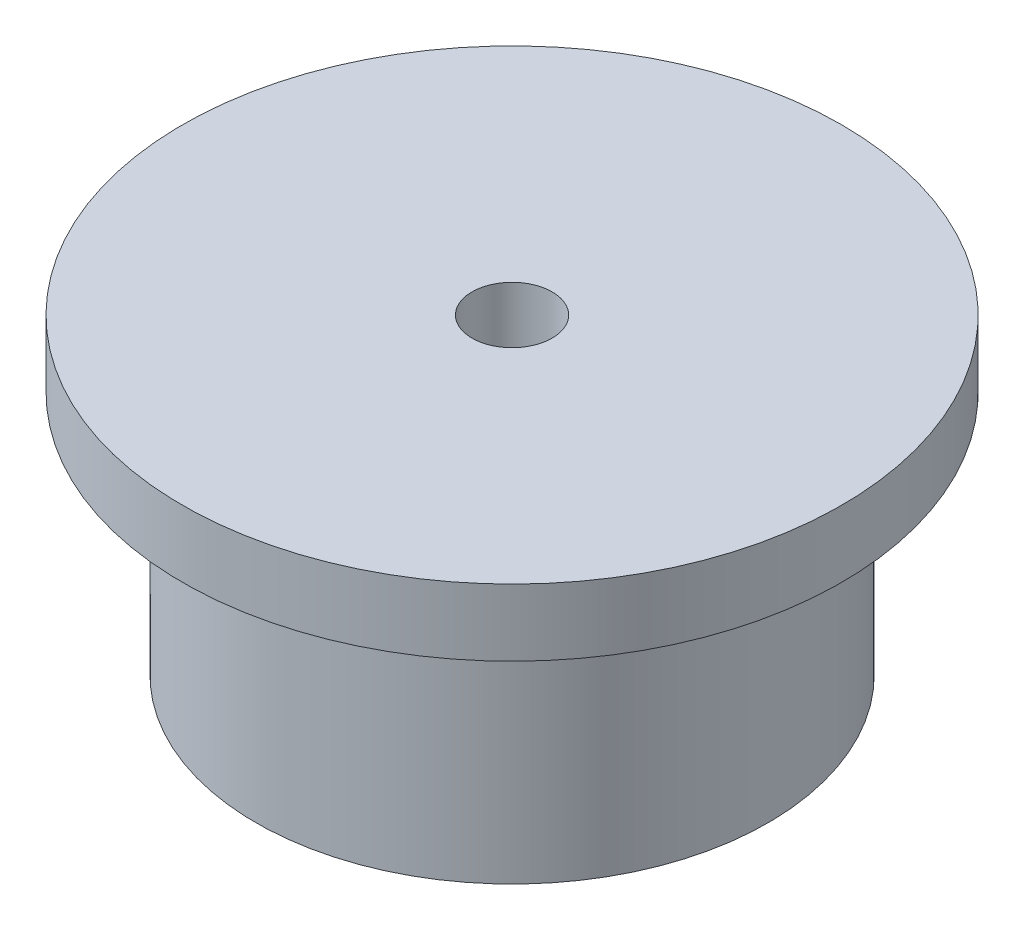
ISO-10303-21;
HEADER;
FILE_DESCRIPTION(('STEP AP214'),'2;1');
FILE_NAME('part.step','',(''),(''),'','','');
FILE_SCHEMA(('AUTOMOTIVE_DESIGN { 1 0 10303 214 1 1 1 1 }'));
ENDSEC;
DATA;
#1=APPLICATION_CONTEXT('core data for automotive mechanical design processes');
#2=APPLICATION_PROTOCOL_DEFINITION('international standard','automotive_design',2000,#1);
#3=PRODUCT_CONTEXT('',#1,'mechanical');
#4=PRODUCT('Part','Part','',(#3));
#5=PRODUCT_RELATED_PRODUCT_CATEGORY('part','',(#4));
#6=PRODUCT_DEFINITION_FORMATION('','',#4);
#7=PRODUCT_DEFINITION_CONTEXT('part definition',#1,'design');
#8=PRODUCT_DEFINITION('design','',#6,#7);
#9=PRODUCT_DEFINITION_SHAPE('','',#8);
#10=(LENGTH_UNIT() NAMED_UNIT(*) SI_UNIT(.MILLI.,.METRE.));
#11=(NAMED_UNIT(*) PLANE_ANGLE_UNIT() SI_UNIT($,.RADIAN.));
#12=(NAMED_UNIT(*) SI_UNIT($,.STERADIAN.) SOLID_ANGLE_UNIT());
#13=UNCERTAINTY_MEASURE_WITH_UNIT(LENGTH_MEASURE(1.E-05),#10,'distance_accuracy_value','');
#14=(GEOMETRIC_REPRESENTATION_CONTEXT(3) GLOBAL_UNCERTAINTY_ASSIGNED_CONTEXT((#13)) GLOBAL_UNIT_ASSIGNED_CONTEXT((#10,
#11,#12)) REPRESENTATION_CONTEXT('',''));
#15=CARTESIAN_POINT('',(0.,0.,0.));
#16=DIRECTION('',(0.,0.,1.));
#17=DIRECTION('',(1.,0.,0.));
#18=AXIS2_PLACEMENT_3D('',#15,#16,#17);
#19=CARTESIAN_POINT('',(0.,24.,-57.5));
#20=DIRECTION('',(0.,-1.,0.));
#21=DIRECTION('',(0.,0.,-1.));
#22=AXIS2_PLACEMENT_3D('',#19,#20,#21);
#23=PLANE('',#22);
#24=CARTESIAN_POINT('',(0.,24.,0.));
#25=DIRECTION('',(0.,-1.,0.));
#26=DIRECTION('',(0.,0.,-1.));
#27=AXIS2_PLACEMENT_3D('',#24,#25,#26);
#28=CIRCLE('',#27,57.5);
#29=CARTESIAN_POINT('',(0.,24.,-57.5));
#30=VERTEX_POINT('',#29);
#31=EDGE_CURVE('E65',#30,#30,#28,.T.);
#32=ORIENTED_EDGE('',*,*,#31,.T.);
#33=EDGE_LOOP('',(#32));
#34=FACE_BOUND('',#33,.T.);
#35=CARTESIAN_POINT('',(0.,24.,0.));
#36=DIRECTION('',(0.,-1.,0.));
#37=DIRECTION('',(0.,0.,-1.));
#38=AXIS2_PLACEMENT_3D('',#35,#36,#37);
#39=CIRCLE('',#38,17.5);
#40=CARTESIAN_POINT('',(0.,24.,-17.5));
#41=VERTEX_POINT('',#40);
#42=EDGE_CURVE('E10',#41,#41,#39,.T.);
#43=ORIENTED_EDGE('',*,*,#42,.F.);
#44=EDGE_LOOP('',(#43));
#45=FACE_BOUND('',#44,.T.);
#46=ADVANCED_FACE('F31',(#34,#45),#23,.T.);
#47=CARTESIAN_POINT('',(0.,0.,0.));
#48=DIRECTION('',(0.,-1.,0.));
#49=DIRECTION('',(0.,0.,-1.));
#50=AXIS2_PLACEMENT_3D('',#47,#48,#49);
#51=CYLINDRICAL_SURFACE('',#50,17.5);
#52=ORIENTED_EDGE('',*,*,#42,.T.);
#53=EDGE_LOOP('',(#52));
#54=FACE_BOUND('',#53,.T.);
#55=CARTESIAN_POINT('',(0.,64.,0.));
#56=DIRECTION('',(0.,-1.,0.));
#57=DIRECTION('',(0.,0.,-1.));
#58=AXIS2_PLACEMENT_3D('',#55,#56,#57);
#59=CIRCLE('',#58,17.5);
#60=CARTESIAN_POINT('',(0.,64.,-17.5));
#61=VERTEX_POINT('',#60);
#62=EDGE_CURVE('E37',#61,#61,#59,.T.);
#63=ORIENTED_EDGE('',*,*,#62,.F.);
#64=EDGE_LOOP('',(#63));
#65=FACE_BOUND('',#64,.T.);
#66=ADVANCED_FACE('F83',(#54,#65),#51,.F.);
#67=CARTESIAN_POINT('',(0.,64.,-17.5));
#68=DIRECTION('',(0.,1.,0.));
#69=DIRECTION('',(0.,0.,1.));
#70=AXIS2_PLACEMENT_3D('',#67,#68,#69);
#71=PLANE('',#70);
#72=ORIENTED_EDGE('',*,*,#62,.T.);
#73=EDGE_LOOP('',(#72));
#74=FACE_BOUND('',#73,.T.);
#75=CARTESIAN_POINT('',(0.,64.,0.));
#76=DIRECTION('',(0.,-1.,0.));
#77=DIRECTION('',(0.,0.,-1.));
#78=AXIS2_PLACEMENT_3D('',#75,#76,#77);
#79=CIRCLE('',#78,25.);
#80=CARTESIAN_POINT('',(0.,64.,-25.));
#81=VERTEX_POINT('',#80);
#82=EDGE_CURVE('E41',#81,#81,#79,.T.);
#83=ORIENTED_EDGE('',*,*,#82,.F.);
#84=EDGE_LOOP('',(#83));
#85=FACE_BOUND('',#84,.T.);
#86=ADVANCED_FACE('F87',(#74,#85),#71,.T.);
#87=CARTESIAN_POINT('',(0.,0.,0.));
#88=DIRECTION('',(0.,-1.,0.));
#89=DIRECTION('',(0.,0.,-1.));
#90=AXIS2_PLACEMENT_3D('',#87,#88,#89);
#91=CYLINDRICAL_SURFACE('',#90,25.);
#92=ORIENTED_EDGE('',*,*,#82,.T.);
#93=EDGE_LOOP('',(#92));
#94=FACE_BOUND('',#93,.T.);
#95=CARTESIAN_POINT('',(0.,74.,0.));
#96=DIRECTION('',(0.,-1.,0.));
#97=DIRECTION('',(0.,0.,-1.));
#98=AXIS2_PLACEMENT_3D('',#95,#96,#97);
#99=CIRCLE('',#98,25.);
#100=CARTESIAN_POINT('',(0.,74.,-25.));
#101=VERTEX_POINT('',#100);
#102=EDGE_CURVE('E45',#101,#101,#99,.T.);
#103=ORIENTED_EDGE('',*,*,#102,.F.);
#104=EDGE_LOOP('',(#103));
#105=FACE_BOUND('',#104,.T.);
#106=ADVANCED_FACE('F91',(#94,#105),#91,.F.);
#107=CARTESIAN_POINT('',(0.,74.,-25.));
#108=DIRECTION('',(0.,-1.,0.));
#109=DIRECTION('',(0.,0.,-1.));
#110=AXIS2_PLACEMENT_3D('',#107,#108,#109);
#111=PLANE('',#110);
#112=ORIENTED_EDGE('',*,*,#102,.T.);
#113=EDGE_LOOP('',(#112));
#114=FACE_BOUND('',#113,.T.);
#115=CARTESIAN_POINT('',(0.,74.,0.));
#116=DIRECTION('',(0.,-1.,0.));
#117=DIRECTION('',(0.,0.,-1.));
#118=AXIS2_PLACEMENT_3D('',#115,#116,#117);
#119=CIRCLE('',#118,9.);
#120=CARTESIAN_POINT('',(0.,74.,-9.));
#121=VERTEX_POINT('',#120);
#122=EDGE_CURVE('E50',#121,#121,#119,.T.);
#123=ORIENTED_EDGE('',*,*,#122,.F.);
#124=EDGE_LOOP('',(#123));
#125=FACE_BOUND('',#124,.T.);
#126=ADVANCED_FACE('F97',(#114,#125),#111,.T.);
#127=CARTESIAN_POINT('',(0.,0.,0.));
#128=DIRECTION('',(0.,-1.,0.));
#129=DIRECTION('',(0.,0.,-1.));
#130=AXIS2_PLACEMENT_3D('',#127,#128,#129);
#131=CYLINDRICAL_SURFACE('',#130,9.);
#132=ORIENTED_EDGE('',*,*,#122,.T.);
#133=EDGE_LOOP('',(#132));
#134=FACE_BOUND('',#133,.T.);
#135=CARTESIAN_POINT('',(0.,94.,0.));
#136=DIRECTION('',(0.,-1.,0.));
#137=DIRECTION('',(0.,0.,-1.));
#138=AXIS2_PLACEMENT_3D('',#135,#136,#137);
#139=CIRCLE('',#138,9.);
#140=CARTESIAN_POINT('',(0.,94.,-9.));
#141=VERTEX_POINT('',#140);
#142=EDGE_CURVE('E53',#141,#141,#139,.T.);
#143=ORIENTED_EDGE('',*,*,#142,.F.);
#144=EDGE_LOOP('',(#143));
#145=FACE_BOUND('',#144,.T.);
#146=ADVANCED_FACE('F101',(#134,#145),#131,.F.);
#147=CARTESIAN_POINT('',(0.,94.,-9.));
#148=DIRECTION('',(0.,1.,0.));
#149=DIRECTION('',(0.,0.,1.));
#150=AXIS2_PLACEMENT_3D('',#147,#148,#149);
#151=PLANE('',#150);
#152=ORIENTED_EDGE('',*,*,#142,.T.);
#153=EDGE_LOOP('',(#152));
#154=FACE_BOUND('',#153,.T.);
#155=CARTESIAN_POINT('',(0.,94.,0.));
#156=DIRECTION('',(0.,-1.,0.));
#157=DIRECTION('',(0.,0.,-1.));
#158=AXIS2_PLACEMENT_3D('',#155,#156,#157);
#159=CIRCLE('',#158,74.);
#160=CARTESIAN_POINT('',(0.,94.,-74.));
#161=VERTEX_POINT('',#160);
#162=EDGE_CURVE('E56',#161,#161,#159,.T.);
#163=ORIENTED_EDGE('',*,*,#162,.F.);
#164=EDGE_LOOP('',(#163));
#165=FACE_BOUND('',#164,.T.);
#166=ADVANCED_FACE('F105',(#154,#165),#151,.T.);
#167=CARTESIAN_POINT('',(0.,0.,0.));
#168=DIRECTION('',(0.,-1.,0.));
#169=DIRECTION('',(0.,0.,-1.));
#170=AXIS2_PLACEMENT_3D('',#167,#168,#169);
#171=CYLINDRICAL_SURFACE('',#170,74.);
#172=ORIENTED_EDGE('',*,*,#162,.T.);
#173=EDGE_LOOP('',(#172));
#174=FACE_BOUND('',#173,.T.);
#175=CARTESIAN_POINT('',(0.,79.,0.));
#176=DIRECTION('',(0.,-1.,0.));
#177=DIRECTION('',(0.,0.,-1.));
#178=AXIS2_PLACEMENT_3D('',#175,#176,#177);
#179=CIRCLE('',#178,74.);
#180=CARTESIAN_POINT('',(0.,79.,-74.));
#181=VERTEX_POINT('',#180);
#182=EDGE_CURVE('E59',#181,#181,#179,.T.);
#183=ORIENTED_EDGE('',*,*,#182,.F.);
#184=EDGE_LOOP('',(#183));
#185=FACE_BOUND('',#184,.T.);
#186=ADVANCED_FACE('F79',(#174,#185),#171,.T.);
#187=CARTESIAN_POINT('',(0.,79.,-74.));
#188=DIRECTION('',(0.,-1.,0.));
#189=DIRECTION('',(0.,0.,-1.));
#190=AXIS2_PLACEMENT_3D('',#187,#188,#189);
#191=PLANE('',#190);
#192=ORIENTED_EDGE('',*,*,#182,.T.);
#193=EDGE_LOOP('',(#192));
#194=FACE_BOUND('',#193,.T.);
#195=CARTESIAN_POINT('',(0.,79.,0.));
#196=DIRECTION('',(0.,-1.,0.));
#197=DIRECTION('',(0.,0.,-1.));
#198=AXIS2_PLACEMENT_3D('',#195,#196,#197);
#199=CIRCLE('',#198,57.5);
#200=CARTESIAN_POINT('',(0.,79.,-57.5));
#201=VERTEX_POINT('',#200);
#202=EDGE_CURVE('E62',#201,#201,#199,.T.);
#203=ORIENTED_EDGE('',*,*,#202,.F.);
#204=EDGE_LOOP('',(#203));
#205=FACE_BOUND('',#204,.T.);
#206=ADVANCED_FACE('F73',(#194,#205),#191,.T.);
#207=CARTESIAN_POINT('',(0.,0.,0.));
#208=DIRECTION('',(0.,-1.,0.));
#209=DIRECTION('',(0.,0.,-1.));
#210=AXIS2_PLACEMENT_3D('',#207,#208,#209);
#211=CYLINDRICAL_SURFACE('',#210,57.5);
#212=ORIENTED_EDGE('',*,*,#202,.T.);
#213=EDGE_LOOP('',(#212));
#214=FACE_BOUND('',#213,.T.);
#215=ORIENTED_EDGE('',*,*,#31,.F.);
#216=EDGE_LOOP('',(#215));
#217=FACE_BOUND('',#216,.T.);
#218=ADVANCED_FACE('F71',(#214,#217),#211,.T.);
#219=CLOSED_SHELL('',(#46,#66,#86,#106,#126,#146,#166,#186,#206,#218));
#220=MANIFOLD_SOLID_BREP('B2',#219);
#221=ADVANCED_BREP_SHAPE_REPRESENTATION('',(#18,#220),#14);
#222=SHAPE_DEFINITION_REPRESENTATION(#9,#221);
ENDSEC;
END-ISO-10303-21;
